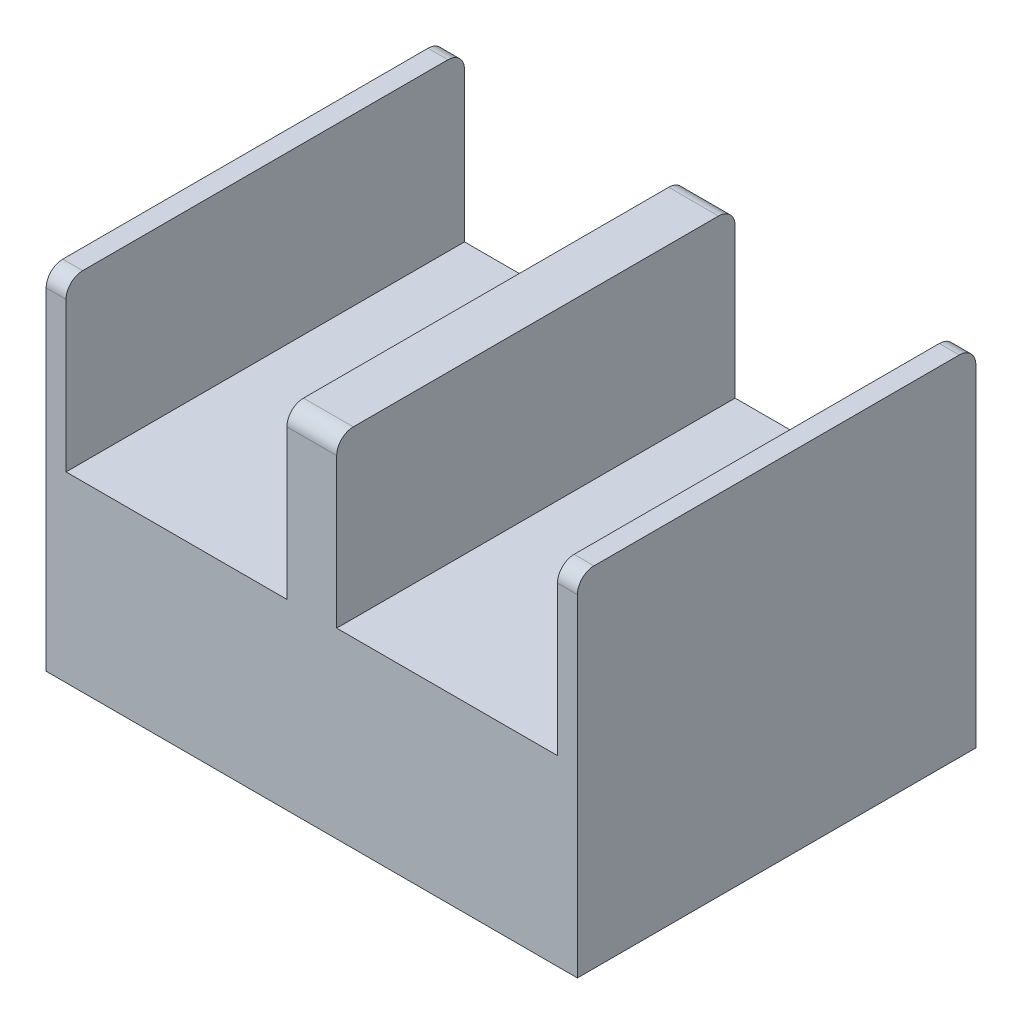
ISO-10303-21;
HEADER;
FILE_DESCRIPTION(('STEP AP214'),'2;1');
FILE_NAME('part.step','',(''),(''),'','','');
FILE_SCHEMA(('AUTOMOTIVE_DESIGN { 1 0 10303 214 1 1 1 1 }'));
ENDSEC;
DATA;
#1=APPLICATION_CONTEXT('core data for automotive mechanical design processes');
#2=APPLICATION_PROTOCOL_DEFINITION('international standard','automotive_design',2000,#1);
#3=PRODUCT_CONTEXT('',#1,'mechanical');
#4=PRODUCT('Part','Part','',(#3));
#5=PRODUCT_RELATED_PRODUCT_CATEGORY('part','',(#4));
#6=PRODUCT_DEFINITION_FORMATION('','',#4);
#7=PRODUCT_DEFINITION_CONTEXT('part definition',#1,'design');
#8=PRODUCT_DEFINITION('design','',#6,#7);
#9=PRODUCT_DEFINITION_SHAPE('','',#8);
#10=(LENGTH_UNIT() NAMED_UNIT(*) SI_UNIT(.MILLI.,.METRE.));
#11=(NAMED_UNIT(*) PLANE_ANGLE_UNIT() SI_UNIT($,.RADIAN.));
#12=(NAMED_UNIT(*) SI_UNIT($,.STERADIAN.) SOLID_ANGLE_UNIT());
#13=UNCERTAINTY_MEASURE_WITH_UNIT(LENGTH_MEASURE(1.E-05),#10,'distance_accuracy_value','');
#14=(GEOMETRIC_REPRESENTATION_CONTEXT(3) GLOBAL_UNCERTAINTY_ASSIGNED_CONTEXT((#13)) GLOBAL_UNIT_ASSIGNED_CONTEXT((#10,
#11,#12)) REPRESENTATION_CONTEXT('',''));
#15=CARTESIAN_POINT('',(0.,0.,0.));
#16=DIRECTION('',(0.,0.,1.));
#17=DIRECTION('',(1.,0.,0.));
#18=AXIS2_PLACEMENT_3D('',#15,#16,#17);
#19=CARTESIAN_POINT('',(0.,5.5,0.));
#20=DIRECTION('',(0.,-1.,0.));
#21=DIRECTION('',(0.,0.,-1.));
#22=AXIS2_PLACEMENT_3D('',#19,#20,#21);
#23=PLANE('',#22);
#24=CARTESIAN_POINT('',(-4.075,5.5,0.));
#25=DIRECTION('',(0.,1.,0.));
#26=DIRECTION('',(0.,0.,1.));
#27=AXIS2_PLACEMENT_3D('',#24,#25,#26);
#28=CIRCLE('',#27,1.25);
#29=CARTESIAN_POINT('',(-4.075,5.5,1.25));
#30=VERTEX_POINT('',#29);
#31=EDGE_CURVE('E314',#30,#30,#28,.T.);
#32=ORIENTED_EDGE('',*,*,#31,.F.);
#33=EDGE_LOOP('',(#32));
#34=FACE_BOUND('',#33,.T.);
#35=DIRECTION('',(0.,0.,1.));
#36=VECTOR('',#35,1.);
#37=CARTESIAN_POINT('',(-0.75,5.5,-6.));
#38=LINE('',#37,#36);
#39=CARTESIAN_POINT('',(-0.750000000000001,5.5,-6.));
#40=VERTEX_POINT('',#39);
#41=CARTESIAN_POINT('',(-0.750000000000001,5.5,6.));
#42=VERTEX_POINT('',#41);
#43=EDGE_CURVE('E184',#40,#42,#38,.T.);
#44=ORIENTED_EDGE('',*,*,#43,.F.);
#45=DIRECTION('',(-1.,0.,0.));
#46=VECTOR('',#45,1.);
#47=CARTESIAN_POINT('',(-8.,5.5,-6.));
#48=LINE('',#47,#46);
#49=CARTESIAN_POINT('',(-7.4,5.5,-6.));
#50=VERTEX_POINT('',#49);
#51=EDGE_CURVE('E223',#40,#50,#48,.T.);
#52=ORIENTED_EDGE('',*,*,#51,.T.);
#53=DIRECTION('',(0.,0.,-1.));
#54=VECTOR('',#53,1.);
#55=CARTESIAN_POINT('',(-7.4,5.5,-6.));
#56=LINE('',#55,#54);
#57=CARTESIAN_POINT('',(-7.4,5.5,6.));
#58=VERTEX_POINT('',#57);
#59=EDGE_CURVE('E209',#58,#50,#56,.T.);
#60=ORIENTED_EDGE('',*,*,#59,.F.);
#61=DIRECTION('',(1.,0.,0.));
#62=VECTOR('',#61,1.);
#63=CARTESIAN_POINT('',(-8.,5.5,6.));
#64=LINE('',#63,#62);
#65=EDGE_CURVE('E177',#58,#42,#64,.T.);
#66=ORIENTED_EDGE('',*,*,#65,.T.);
#67=EDGE_LOOP('',(#44,#52,#60,#66));
#68=FACE_BOUND('',#67,.T.);
#69=ADVANCED_FACE('F34',(#34,#68),#23,.F.);
#70=CARTESIAN_POINT('',(4.075,5.5,0.));
#71=DIRECTION('',(0.,1.,0.));
#72=DIRECTION('',(0.,0.,1.));
#73=AXIS2_PLACEMENT_3D('',#70,#71,#72);
#74=CIRCLE('',#73,1.25);
#75=CARTESIAN_POINT('',(4.075,5.5,1.25));
#76=VERTEX_POINT('',#75);
#77=EDGE_CURVE('E311',#76,#76,#74,.T.);
#78=ORIENTED_EDGE('',*,*,#77,.F.);
#79=EDGE_LOOP('',(#78));
#80=FACE_BOUND('',#79,.T.);
#81=DIRECTION('',(0.,0.,-1.));
#82=VECTOR('',#81,1.);
#83=CARTESIAN_POINT('',(0.75,5.5,-6.));
#84=LINE('',#83,#82);
#85=CARTESIAN_POINT('',(0.749999999999998,5.5,6.));
#86=VERTEX_POINT('',#85);
#87=CARTESIAN_POINT('',(0.750000000000001,5.5,-6.));
#88=VERTEX_POINT('',#87);
#89=EDGE_CURVE('E163',#86,#88,#84,.T.);
#90=ORIENTED_EDGE('',*,*,#89,.F.);
#91=CARTESIAN_POINT('',(7.4,5.5,6.));
#92=VERTEX_POINT('',#91);
#93=EDGE_CURVE('E171',#86,#92,#64,.T.);
#94=ORIENTED_EDGE('',*,*,#93,.T.);
#95=DIRECTION('',(0.,0.,1.));
#96=VECTOR('',#95,1.);
#97=CARTESIAN_POINT('',(7.4,5.5,6.));
#98=LINE('',#97,#96);
#99=CARTESIAN_POINT('',(7.4,5.5,-6.));
#100=VERTEX_POINT('',#99);
#101=EDGE_CURVE('E198',#100,#92,#98,.T.);
#102=ORIENTED_EDGE('',*,*,#101,.F.);
#103=EDGE_CURVE('E178',#100,#88,#48,.T.);
#104=ORIENTED_EDGE('',*,*,#103,.T.);
#105=EDGE_LOOP('',(#90,#94,#102,#104));
#106=FACE_BOUND('',#105,.T.);
#107=ADVANCED_FACE('F181',(#80,#106),#23,.F.);
#108=CARTESIAN_POINT('',(8.,5.5,6.));
#109=DIRECTION('',(-1.,0.,0.));
#110=DIRECTION('',(0.,0.,1.));
#111=AXIS2_PLACEMENT_3D('',#108,#109,#110);
#112=PLANE('',#111);
#113=DIRECTION('',(0.,-1.,0.));
#114=VECTOR('',#113,1.);
#115=CARTESIAN_POINT('',(8.,5.5,-6.));
#116=LINE('',#115,#114);
#117=CARTESIAN_POINT('',(8.,10.,-6.));
#118=VERTEX_POINT('',#117);
#119=CARTESIAN_POINT('',(8.,0.,-6.));
#120=VERTEX_POINT('',#119);
#121=EDGE_CURVE('E243',#118,#120,#116,.T.);
#122=ORIENTED_EDGE('',*,*,#121,.F.);
#123=CARTESIAN_POINT('',(8.,10.,-5.5));
#124=DIRECTION('',(-1.,0.,0.));
#125=DIRECTION('',(0.,0.,1.));
#126=AXIS2_PLACEMENT_3D('',#123,#124,#125);
#127=CIRCLE('',#126,0.5);
#128=CARTESIAN_POINT('',(8.,10.5,-5.5));
#129=VERTEX_POINT('',#128);
#130=EDGE_CURVE('E289',#118,#129,#127,.F.);
#131=ORIENTED_EDGE('',*,*,#130,.T.);
#132=DIRECTION('',(0.,0.,-1.));
#133=VECTOR('',#132,1.);
#134=CARTESIAN_POINT('',(8.,10.5,6.));
#135=LINE('',#134,#133);
#136=CARTESIAN_POINT('',(8.,10.5,5.5));
#137=VERTEX_POINT('',#136);
#138=EDGE_CURVE('E199',#137,#129,#135,.T.);
#139=ORIENTED_EDGE('',*,*,#138,.F.);
#140=CARTESIAN_POINT('',(8.,10.,5.5));
#141=DIRECTION('',(-1.,0.,0.));
#142=DIRECTION('',(0.,0.,1.));
#143=AXIS2_PLACEMENT_3D('',#140,#141,#142);
#144=CIRCLE('',#143,0.5);
#145=CARTESIAN_POINT('',(8.,10.,6.));
#146=VERTEX_POINT('',#145);
#147=EDGE_CURVE('E50',#137,#146,#144,.F.);
#148=ORIENTED_EDGE('',*,*,#147,.T.);
#149=DIRECTION('',(0.,-1.,0.));
#150=VECTOR('',#149,1.);
#151=CARTESIAN_POINT('',(8.,5.5,6.));
#152=LINE('',#151,#150);
#153=CARTESIAN_POINT('',(8.,0.,6.));
#154=VERTEX_POINT('',#153);
#155=EDGE_CURVE('E226',#146,#154,#152,.T.);
#156=ORIENTED_EDGE('',*,*,#155,.T.);
#157=DIRECTION('',(0.,0.,-1.));
#158=VECTOR('',#157,1.);
#159=CARTESIAN_POINT('',(8.,0.,6.));
#160=LINE('',#159,#158);
#161=EDGE_CURVE('E222',#154,#120,#160,.T.);
#162=ORIENTED_EDGE('',*,*,#161,.T.);
#163=EDGE_LOOP('',(#122,#131,#139,#148,#156,#162));
#164=FACE_BOUND('',#163,.T.);
#165=ADVANCED_FACE('F335',(#164),#112,.F.);
#166=CARTESIAN_POINT('',(-8.,5.5,-6.));
#167=DIRECTION('',(0.,0.,1.));
#168=DIRECTION('',(1.,0.,0.));
#169=AXIS2_PLACEMENT_3D('',#166,#167,#168);
#170=PLANE('',#169);
#171=DIRECTION('',(0.,-1.,0.));
#172=VECTOR('',#171,1.);
#173=CARTESIAN_POINT('',(-8.,5.5,-6.));
#174=LINE('',#173,#172);
#175=CARTESIAN_POINT('',(-8.,10.,-6.));
#176=VERTEX_POINT('',#175);
#177=CARTESIAN_POINT('',(-8.,0.,-6.));
#178=VERTEX_POINT('',#177);
#179=EDGE_CURVE('E241',#176,#178,#174,.T.);
#180=ORIENTED_EDGE('',*,*,#179,.F.);
#181=DIRECTION('',(-1.,0.,0.));
#182=VECTOR('',#181,1.);
#183=CARTESIAN_POINT('',(-7.4,10.,-6.));
#184=LINE('',#183,#182);
#185=CARTESIAN_POINT('',(-7.4,10.,-6.));
#186=VERTEX_POINT('',#185);
#187=EDGE_CURVE('E259',#176,#186,#184,.F.);
#188=ORIENTED_EDGE('',*,*,#187,.T.);
#189=DIRECTION('',(0.,-1.,0.));
#190=VECTOR('',#189,1.);
#191=CARTESIAN_POINT('',(-7.4,10.5,-6.));
#192=LINE('',#191,#190);
#193=EDGE_CURVE('E216',#186,#50,#192,.T.);
#194=ORIENTED_EDGE('',*,*,#193,.T.);
#195=ORIENTED_EDGE('',*,*,#51,.F.);
#196=DIRECTION('',(0.,-1.,0.));
#197=VECTOR('',#196,1.);
#198=CARTESIAN_POINT('',(-0.75,10.5,-6.));
#199=LINE('',#198,#197);
#200=CARTESIAN_POINT('',(-0.75,10.,-6.));
#201=VERTEX_POINT('',#200);
#202=EDGE_CURVE('E194',#201,#40,#199,.T.);
#203=ORIENTED_EDGE('',*,*,#202,.F.);
#204=DIRECTION('',(-1.,0.,0.));
#205=VECTOR('',#204,1.);
#206=CARTESIAN_POINT('',(0.75,10.,-6.));
#207=LINE('',#206,#205);
#208=CARTESIAN_POINT('',(0.75,10.,-6.));
#209=VERTEX_POINT('',#208);
#210=EDGE_CURVE('E257',#201,#209,#207,.F.);
#211=ORIENTED_EDGE('',*,*,#210,.T.);
#212=DIRECTION('',(0.,-1.,0.));
#213=VECTOR('',#212,1.);
#214=CARTESIAN_POINT('',(0.75,10.5,-6.));
#215=LINE('',#214,#213);
#216=EDGE_CURVE('E168',#209,#88,#215,.T.);
#217=ORIENTED_EDGE('',*,*,#216,.T.);
#218=ORIENTED_EDGE('',*,*,#103,.F.);
#219=DIRECTION('',(0.,-1.,0.));
#220=VECTOR('',#219,1.);
#221=CARTESIAN_POINT('',(7.4,10.5,-6.));
#222=LINE('',#221,#220);
#223=CARTESIAN_POINT('',(7.4,10.,-6.));
#224=VERTEX_POINT('',#223);
#225=EDGE_CURVE('E207',#224,#100,#222,.T.);
#226=ORIENTED_EDGE('',*,*,#225,.F.);
#227=DIRECTION('',(-1.,0.,0.));
#228=VECTOR('',#227,1.);
#229=CARTESIAN_POINT('',(8.,10.,-6.));
#230=LINE('',#229,#228);
#231=EDGE_CURVE('E255',#224,#118,#230,.F.);
#232=ORIENTED_EDGE('',*,*,#231,.T.);
#233=ORIENTED_EDGE('',*,*,#121,.T.);
#234=DIRECTION('',(-1.,0.,0.));
#235=VECTOR('',#234,1.);
#236=CARTESIAN_POINT('',(-8.,0.,-6.));
#237=LINE('',#236,#235);
#238=EDGE_CURVE('E229',#120,#178,#237,.T.);
#239=ORIENTED_EDGE('',*,*,#238,.T.);
#240=EDGE_LOOP('',(#180,#188,#194,#195,#203,#211,#217,#218,#226,#232,#233,#239));
#241=FACE_BOUND('',#240,.T.);
#242=ADVANCED_FACE('F347',(#241),#170,.F.);
#243=CARTESIAN_POINT('',(-8.,5.5,6.));
#244=DIRECTION('',(1.,0.,0.));
#245=DIRECTION('',(0.,0.,-1.));
#246=AXIS2_PLACEMENT_3D('',#243,#244,#245);
#247=PLANE('',#246);
#248=DIRECTION('',(0.,0.,1.));
#249=VECTOR('',#248,1.);
#250=CARTESIAN_POINT('',(-8.,10.5,-6.));
#251=LINE('',#250,#249);
#252=CARTESIAN_POINT('',(-8.,10.5,-5.5));
#253=VERTEX_POINT('',#252);
#254=CARTESIAN_POINT('',(-8.,10.5,5.5));
#255=VERTEX_POINT('',#254);
#256=EDGE_CURVE('E210',#253,#255,#251,.T.);
#257=ORIENTED_EDGE('',*,*,#256,.F.);
#258=CARTESIAN_POINT('',(-8.,10.,-5.5));
#259=DIRECTION('',(1.,0.,0.));
#260=DIRECTION('',(0.,0.,-1.));
#261=AXIS2_PLACEMENT_3D('',#258,#259,#260);
#262=CIRCLE('',#261,0.5);
#263=EDGE_CURVE('E253',#253,#176,#262,.F.);
#264=ORIENTED_EDGE('',*,*,#263,.T.);
#265=ORIENTED_EDGE('',*,*,#179,.T.);
#266=DIRECTION('',(0.,0.,1.));
#267=VECTOR('',#266,1.);
#268=CARTESIAN_POINT('',(-8.,0.,6.));
#269=LINE('',#268,#267);
#270=CARTESIAN_POINT('',(-8.,0.,6.));
#271=VERTEX_POINT('',#270);
#272=EDGE_CURVE('E232',#178,#271,#269,.T.);
#273=ORIENTED_EDGE('',*,*,#272,.T.);
#274=DIRECTION('',(0.,-1.,0.));
#275=VECTOR('',#274,1.);
#276=CARTESIAN_POINT('',(-8.,5.5,6.));
#277=LINE('',#276,#275);
#278=CARTESIAN_POINT('',(-8.,10.,6.));
#279=VERTEX_POINT('',#278);
#280=EDGE_CURVE('E239',#279,#271,#277,.T.);
#281=ORIENTED_EDGE('',*,*,#280,.F.);
#282=CARTESIAN_POINT('',(-8.,10.,5.5));
#283=DIRECTION('',(1.,0.,0.));
#284=DIRECTION('',(0.,0.,-1.));
#285=AXIS2_PLACEMENT_3D('',#282,#283,#284);
#286=CIRCLE('',#285,0.5);
#287=EDGE_CURVE('E251',#279,#255,#286,.F.);
#288=ORIENTED_EDGE('',*,*,#287,.T.);
#289=EDGE_LOOP('',(#257,#264,#265,#273,#281,#288));
#290=FACE_BOUND('',#289,.T.);
#291=ADVANCED_FACE('F343',(#290),#247,.F.);
#292=CARTESIAN_POINT('',(-8.,5.5,6.));
#293=DIRECTION('',(0.,0.,-1.));
#294=DIRECTION('',(-1.,0.,0.));
#295=AXIS2_PLACEMENT_3D('',#292,#293,#294);
#296=PLANE('',#295);
#297=ORIENTED_EDGE('',*,*,#155,.F.);
#298=DIRECTION('',(1.,0.,0.));
#299=VECTOR('',#298,1.);
#300=CARTESIAN_POINT('',(7.4,10.,6.));
#301=LINE('',#300,#299);
#302=CARTESIAN_POINT('',(7.4,10.,6.));
#303=VERTEX_POINT('',#302);
#304=EDGE_CURVE('E11',#146,#303,#301,.F.);
#305=ORIENTED_EDGE('',*,*,#304,.T.);
#306=DIRECTION('',(0.,-1.,0.));
#307=VECTOR('',#306,1.);
#308=CARTESIAN_POINT('',(7.4,10.5,6.));
#309=LINE('',#308,#307);
#310=EDGE_CURVE('E173',#303,#92,#309,.T.);
#311=ORIENTED_EDGE('',*,*,#310,.T.);
#312=ORIENTED_EDGE('',*,*,#93,.F.);
#313=DIRECTION('',(0.,-1.,0.));
#314=VECTOR('',#313,1.);
#315=CARTESIAN_POINT('',(0.749999999999998,10.5,6.));
#316=LINE('',#315,#314);
#317=CARTESIAN_POINT('',(0.749999999999998,10.,6.));
#318=VERTEX_POINT('',#317);
#319=EDGE_CURVE('E158',#318,#86,#316,.T.);
#320=ORIENTED_EDGE('',*,*,#319,.F.);
#321=DIRECTION('',(1.,0.,0.));
#322=VECTOR('',#321,1.);
#323=CARTESIAN_POINT('',(-0.749999999999998,10.,6.));
#324=LINE('',#323,#322);
#325=CARTESIAN_POINT('',(-0.749999999999998,10.,6.));
#326=VERTEX_POINT('',#325);
#327=EDGE_CURVE('E43',#318,#326,#324,.F.);
#328=ORIENTED_EDGE('',*,*,#327,.T.);
#329=DIRECTION('',(0.,-1.,0.));
#330=VECTOR('',#329,1.);
#331=CARTESIAN_POINT('',(-0.749999999999998,10.5,6.));
#332=LINE('',#331,#330);
#333=EDGE_CURVE('E167',#326,#42,#332,.T.);
#334=ORIENTED_EDGE('',*,*,#333,.T.);
#335=ORIENTED_EDGE('',*,*,#65,.F.);
#336=DIRECTION('',(0.,-1.,0.));
#337=VECTOR('',#336,1.);
#338=CARTESIAN_POINT('',(-7.4,10.5,6.));
#339=LINE('',#338,#337);
#340=CARTESIAN_POINT('',(-7.4,10.,6.));
#341=VERTEX_POINT('',#340);
#342=EDGE_CURVE('E220',#341,#58,#339,.T.);
#343=ORIENTED_EDGE('',*,*,#342,.F.);
#344=DIRECTION('',(1.,0.,0.));
#345=VECTOR('',#344,1.);
#346=CARTESIAN_POINT('',(-8.,10.,6.));
#347=LINE('',#346,#345);
#348=EDGE_CURVE('E291',#341,#279,#347,.F.);
#349=ORIENTED_EDGE('',*,*,#348,.T.);
#350=ORIENTED_EDGE('',*,*,#280,.T.);
#351=DIRECTION('',(1.,0.,0.));
#352=VECTOR('',#351,1.);
#353=CARTESIAN_POINT('',(-8.,0.,6.));
#354=LINE('',#353,#352);
#355=EDGE_CURVE('E235',#271,#154,#354,.T.);
#356=ORIENTED_EDGE('',*,*,#355,.T.);
#357=EDGE_LOOP('',(#297,#305,#311,#312,#320,#328,#334,#335,#343,#349,#350,#356));
#358=FACE_BOUND('',#357,.T.);
#359=ADVANCED_FACE('F172',(#358),#296,.F.);
#360=CARTESIAN_POINT('',(0.,0.,0.));
#361=DIRECTION('',(0.,-1.,0.));
#362=DIRECTION('',(0.,0.,-1.));
#363=AXIS2_PLACEMENT_3D('',#360,#361,#362);
#364=PLANE('',#363);
#365=CARTESIAN_POINT('',(-4.075,0.,0.));
#366=DIRECTION('',(0.,-1.,0.));
#367=DIRECTION('',(0.,0.,-1.));
#368=AXIS2_PLACEMENT_3D('',#365,#366,#367);
#369=CIRCLE('',#368,1.25);
#370=CARTESIAN_POINT('',(-4.075,0.,-1.25));
#371=VERTEX_POINT('',#370);
#372=EDGE_CURVE('E38',#371,#371,#369,.T.);
#373=ORIENTED_EDGE('',*,*,#372,.F.);
#374=EDGE_LOOP('',(#373));
#375=FACE_BOUND('',#374,.T.);
#376=CARTESIAN_POINT('',(4.075,0.,0.));
#377=DIRECTION('',(0.,-1.,0.));
#378=DIRECTION('',(0.,0.,-1.));
#379=AXIS2_PLACEMENT_3D('',#376,#377,#378);
#380=CIRCLE('',#379,1.25);
#381=CARTESIAN_POINT('',(4.075,0.,-1.25));
#382=VERTEX_POINT('',#381);
#383=EDGE_CURVE('E190',#382,#382,#380,.T.);
#384=ORIENTED_EDGE('',*,*,#383,.F.);
#385=EDGE_LOOP('',(#384));
#386=FACE_BOUND('',#385,.T.);
#387=ORIENTED_EDGE('',*,*,#161,.F.);
#388=ORIENTED_EDGE('',*,*,#355,.F.);
#389=ORIENTED_EDGE('',*,*,#272,.F.);
#390=ORIENTED_EDGE('',*,*,#238,.F.);
#391=EDGE_LOOP('',(#387,#388,#389,#390));
#392=FACE_BOUND('',#391,.T.);
#393=ADVANCED_FACE('F323',(#375,#386,#392),#364,.T.);
#394=CARTESIAN_POINT('',(-7.4,10.5,-6.));
#395=DIRECTION('',(-1.,0.,0.));
#396=DIRECTION('',(0.,0.,1.));
#397=AXIS2_PLACEMENT_3D('',#394,#395,#396);
#398=PLANE('',#397);
#399=ORIENTED_EDGE('',*,*,#193,.F.);
#400=CARTESIAN_POINT('',(-7.4,10.,-5.5));
#401=DIRECTION('',(-1.,0.,0.));
#402=DIRECTION('',(0.,0.,1.));
#403=AXIS2_PLACEMENT_3D('',#400,#401,#402);
#404=CIRCLE('',#403,0.5);
#405=CARTESIAN_POINT('',(-7.4,10.5,-5.5));
#406=VERTEX_POINT('',#405);
#407=EDGE_CURVE('E263',#186,#406,#404,.F.);
#408=ORIENTED_EDGE('',*,*,#407,.T.);
#409=DIRECTION('',(0.,0.,-1.));
#410=VECTOR('',#409,1.);
#411=CARTESIAN_POINT('',(-7.4,10.5,-6.));
#412=LINE('',#411,#410);
#413=CARTESIAN_POINT('',(-7.4,10.5,5.5));
#414=VERTEX_POINT('',#413);
#415=EDGE_CURVE('E213',#414,#406,#412,.T.);
#416=ORIENTED_EDGE('',*,*,#415,.F.);
#417=CARTESIAN_POINT('',(-7.4,10.,5.5));
#418=DIRECTION('',(-1.,0.,0.));
#419=DIRECTION('',(0.,0.,1.));
#420=AXIS2_PLACEMENT_3D('',#417,#418,#419);
#421=CIRCLE('',#420,0.5);
#422=EDGE_CURVE('E261',#414,#341,#421,.F.);
#423=ORIENTED_EDGE('',*,*,#422,.T.);
#424=ORIENTED_EDGE('',*,*,#342,.T.);
#425=ORIENTED_EDGE('',*,*,#59,.T.);
#426=EDGE_LOOP('',(#399,#408,#416,#423,#424,#425));
#427=FACE_BOUND('',#426,.T.);
#428=ADVANCED_FACE('F326',(#427),#398,.F.);
#429=CARTESIAN_POINT('',(0.,10.5,0.));
#430=DIRECTION('',(0.,1.,0.));
#431=DIRECTION('',(0.,0.,1.));
#432=AXIS2_PLACEMENT_3D('',#429,#430,#431);
#433=PLANE('',#432);
#434=ORIENTED_EDGE('',*,*,#415,.T.);
#435=DIRECTION('',(-1.,0.,0.));
#436=VECTOR('',#435,1.);
#437=CARTESIAN_POINT('',(-8.,10.5,-5.5));
#438=LINE('',#437,#436);
#439=EDGE_CURVE('E248',#406,#253,#438,.T.);
#440=ORIENTED_EDGE('',*,*,#439,.T.);
#441=ORIENTED_EDGE('',*,*,#256,.T.);
#442=DIRECTION('',(1.,0.,0.));
#443=VECTOR('',#442,1.);
#444=CARTESIAN_POINT('',(-7.4,10.5,5.5));
#445=LINE('',#444,#443);
#446=EDGE_CURVE('E245',#255,#414,#445,.T.);
#447=ORIENTED_EDGE('',*,*,#446,.T.);
#448=EDGE_LOOP('',(#434,#440,#441,#447));
#449=FACE_BOUND('',#448,.T.);
#450=ADVANCED_FACE('F377',(#449),#433,.T.);
#451=CARTESIAN_POINT('',(7.4,10.5,6.));
#452=DIRECTION('',(1.,0.,0.));
#453=DIRECTION('',(0.,0.,-1.));
#454=AXIS2_PLACEMENT_3D('',#451,#452,#453);
#455=PLANE('',#454);
#456=DIRECTION('',(0.,0.,1.));
#457=VECTOR('',#456,1.);
#458=CARTESIAN_POINT('',(7.4,10.5,6.));
#459=LINE('',#458,#457);
#460=CARTESIAN_POINT('',(7.4,10.5,-5.5));
#461=VERTEX_POINT('',#460);
#462=CARTESIAN_POINT('',(7.4,10.5,5.5));
#463=VERTEX_POINT('',#462);
#464=EDGE_CURVE('E202',#461,#463,#459,.T.);
#465=ORIENTED_EDGE('',*,*,#464,.F.);
#466=CARTESIAN_POINT('',(7.4,10.,-5.5));
#467=DIRECTION('',(1.,0.,0.));
#468=DIRECTION('',(0.,0.,-1.));
#469=AXIS2_PLACEMENT_3D('',#466,#467,#468);
#470=CIRCLE('',#469,0.5);
#471=EDGE_CURVE('E286',#461,#224,#470,.F.);
#472=ORIENTED_EDGE('',*,*,#471,.T.);
#473=ORIENTED_EDGE('',*,*,#225,.T.);
#474=ORIENTED_EDGE('',*,*,#101,.T.);
#475=ORIENTED_EDGE('',*,*,#310,.F.);
#476=CARTESIAN_POINT('',(7.4,10.,5.5));
#477=DIRECTION('',(1.,0.,0.));
#478=DIRECTION('',(0.,0.,-1.));
#479=AXIS2_PLACEMENT_3D('',#476,#477,#478);
#480=CIRCLE('',#479,0.5);
#481=EDGE_CURVE('E284',#303,#463,#480,.F.);
#482=ORIENTED_EDGE('',*,*,#481,.T.);
#483=EDGE_LOOP('',(#465,#472,#473,#474,#475,#482));
#484=FACE_BOUND('',#483,.T.);
#485=ADVANCED_FACE('F361',(#484),#455,.F.);
#486=CARTESIAN_POINT('',(0.,10.5,0.));
#487=DIRECTION('',(0.,1.,0.));
#488=DIRECTION('',(0.,0.,1.));
#489=AXIS2_PLACEMENT_3D('',#486,#487,#488);
#490=PLANE('',#489);
#491=ORIENTED_EDGE('',*,*,#138,.T.);
#492=DIRECTION('',(-1.,0.,0.));
#493=VECTOR('',#492,1.);
#494=CARTESIAN_POINT('',(7.4,10.5,-5.5));
#495=LINE('',#494,#493);
#496=EDGE_CURVE('E281',#129,#461,#495,.T.);
#497=ORIENTED_EDGE('',*,*,#496,.T.);
#498=ORIENTED_EDGE('',*,*,#464,.T.);
#499=DIRECTION('',(1.,0.,0.));
#500=VECTOR('',#499,1.);
#501=CARTESIAN_POINT('',(8.,10.5,5.5));
#502=LINE('',#501,#500);
#503=EDGE_CURVE('E278',#463,#137,#502,.T.);
#504=ORIENTED_EDGE('',*,*,#503,.T.);
#505=EDGE_LOOP('',(#491,#497,#498,#504));
#506=FACE_BOUND('',#505,.T.);
#507=ADVANCED_FACE('F354',(#506),#490,.T.);
#508=CARTESIAN_POINT('',(-0.75,10.5,-6.));
#509=DIRECTION('',(1.,0.,0.));
#510=DIRECTION('',(0.,0.,-1.));
#511=AXIS2_PLACEMENT_3D('',#508,#509,#510);
#512=PLANE('',#511);
#513=DIRECTION('',(0.,0.,1.));
#514=VECTOR('',#513,1.);
#515=CARTESIAN_POINT('',(-0.75,10.5,-6.));
#516=LINE('',#515,#514);
#517=CARTESIAN_POINT('',(-0.75,10.5,-5.5));
#518=VERTEX_POINT('',#517);
#519=CARTESIAN_POINT('',(-0.749999999999999,10.5,5.5));
#520=VERTEX_POINT('',#519);
#521=EDGE_CURVE('E183',#518,#520,#516,.T.);
#522=ORIENTED_EDGE('',*,*,#521,.F.);
#523=CARTESIAN_POINT('',(-0.75,10.,-5.5));
#524=DIRECTION('',(1.,0.,0.));
#525=DIRECTION('',(0.,0.,-1.));
#526=AXIS2_PLACEMENT_3D('',#523,#524,#525);
#527=CIRCLE('',#526,0.5);
#528=EDGE_CURVE('E273',#518,#201,#527,.F.);
#529=ORIENTED_EDGE('',*,*,#528,.T.);
#530=ORIENTED_EDGE('',*,*,#202,.T.);
#531=ORIENTED_EDGE('',*,*,#43,.T.);
#532=ORIENTED_EDGE('',*,*,#333,.F.);
#533=CARTESIAN_POINT('',(-0.749999999999999,10.,5.5));
#534=DIRECTION('',(1.,0.,0.));
#535=DIRECTION('',(0.,0.,-1.));
#536=AXIS2_PLACEMENT_3D('',#533,#534,#535);
#537=CIRCLE('',#536,0.5);
#538=EDGE_CURVE('E271',#326,#520,#537,.F.);
#539=ORIENTED_EDGE('',*,*,#538,.T.);
#540=EDGE_LOOP('',(#522,#529,#530,#531,#532,#539));
#541=FACE_BOUND('',#540,.T.);
#542=ADVANCED_FACE('F299',(#541),#512,.F.);
#543=CARTESIAN_POINT('',(0.75,10.5,-6.));
#544=DIRECTION('',(-1.,0.,0.));
#545=DIRECTION('',(0.,0.,1.));
#546=AXIS2_PLACEMENT_3D('',#543,#544,#545);
#547=PLANE('',#546);
#548=ORIENTED_EDGE('',*,*,#216,.F.);
#549=CARTESIAN_POINT('',(0.75,10.,-5.5));
#550=DIRECTION('',(-1.,0.,0.));
#551=DIRECTION('',(0.,0.,1.));
#552=AXIS2_PLACEMENT_3D('',#549,#550,#551);
#553=CIRCLE('',#552,0.5);
#554=CARTESIAN_POINT('',(0.75,10.5,-5.5));
#555=VERTEX_POINT('',#554);
#556=EDGE_CURVE('E276',#209,#555,#553,.F.);
#557=ORIENTED_EDGE('',*,*,#556,.T.);
#558=DIRECTION('',(0.,0.,-1.));
#559=VECTOR('',#558,1.);
#560=CARTESIAN_POINT('',(0.75,10.5,-6.));
#561=LINE('',#560,#559);
#562=CARTESIAN_POINT('',(0.749999999999999,10.5,5.5));
#563=VERTEX_POINT('',#562);
#564=EDGE_CURVE('E187',#563,#555,#561,.T.);
#565=ORIENTED_EDGE('',*,*,#564,.F.);
#566=CARTESIAN_POINT('',(0.749999999999999,10.,5.5));
#567=DIRECTION('',(-1.,0.,0.));
#568=DIRECTION('',(0.,0.,1.));
#569=AXIS2_PLACEMENT_3D('',#566,#567,#568);
#570=CIRCLE('',#569,0.5);
#571=EDGE_CURVE('E165',#563,#318,#570,.F.);
#572=ORIENTED_EDGE('',*,*,#571,.T.);
#573=ORIENTED_EDGE('',*,*,#319,.T.);
#574=ORIENTED_EDGE('',*,*,#89,.T.);
#575=EDGE_LOOP('',(#548,#557,#565,#572,#573,#574));
#576=FACE_BOUND('',#575,.T.);
#577=ADVANCED_FACE('F161',(#576),#547,.F.);
#578=CARTESIAN_POINT('',(0.,10.5,0.));
#579=DIRECTION('',(0.,1.,0.));
#580=DIRECTION('',(0.,0.,1.));
#581=AXIS2_PLACEMENT_3D('',#578,#579,#580);
#582=PLANE('',#581);
#583=ORIENTED_EDGE('',*,*,#564,.T.);
#584=DIRECTION('',(-1.,0.,0.));
#585=VECTOR('',#584,1.);
#586=CARTESIAN_POINT('',(-0.75,10.5,-5.5));
#587=LINE('',#586,#585);
#588=EDGE_CURVE('E268',#555,#518,#587,.T.);
#589=ORIENTED_EDGE('',*,*,#588,.T.);
#590=ORIENTED_EDGE('',*,*,#521,.T.);
#591=DIRECTION('',(1.,0.,0.));
#592=VECTOR('',#591,1.);
#593=CARTESIAN_POINT('',(0.749999999999998,10.5,5.5));
#594=LINE('',#593,#592);
#595=EDGE_CURVE('E265',#520,#563,#594,.T.);
#596=ORIENTED_EDGE('',*,*,#595,.T.);
#597=EDGE_LOOP('',(#583,#589,#590,#596));
#598=FACE_BOUND('',#597,.T.);
#599=ADVANCED_FACE('F305',(#598),#582,.T.);
#600=CARTESIAN_POINT('',(0.,10.,-5.5));
#601=DIRECTION('',(1.,0.,0.));
#602=DIRECTION('',(0.,0.,-1.));
#603=AXIS2_PLACEMENT_3D('',#600,#601,#602);
#604=CYLINDRICAL_SURFACE('',#603,0.5);
#605=ORIENTED_EDGE('',*,*,#407,.F.);
#606=ORIENTED_EDGE('',*,*,#187,.F.);
#607=ORIENTED_EDGE('',*,*,#263,.F.);
#608=ORIENTED_EDGE('',*,*,#439,.F.);
#609=EDGE_LOOP('',(#605,#606,#607,#608));
#610=FACE_BOUND('',#609,.T.);
#611=ADVANCED_FACE('F380',(#610),#604,.T.);
#612=CARTESIAN_POINT('',(0.,10.,-5.5));
#613=DIRECTION('',(1.,0.,0.));
#614=DIRECTION('',(0.,0.,-1.));
#615=AXIS2_PLACEMENT_3D('',#612,#613,#614);
#616=CYLINDRICAL_SURFACE('',#615,0.5);
#617=ORIENTED_EDGE('',*,*,#556,.F.);
#618=ORIENTED_EDGE('',*,*,#210,.F.);
#619=ORIENTED_EDGE('',*,*,#528,.F.);
#620=ORIENTED_EDGE('',*,*,#588,.F.);
#621=EDGE_LOOP('',(#617,#618,#619,#620));
#622=FACE_BOUND('',#621,.T.);
#623=ADVANCED_FACE('F365',(#622),#616,.T.);
#624=CARTESIAN_POINT('',(0.,10.,-5.5));
#625=DIRECTION('',(1.,0.,0.));
#626=DIRECTION('',(0.,0.,-1.));
#627=AXIS2_PLACEMENT_3D('',#624,#625,#626);
#628=CYLINDRICAL_SURFACE('',#627,0.5);
#629=ORIENTED_EDGE('',*,*,#130,.F.);
#630=ORIENTED_EDGE('',*,*,#231,.F.);
#631=ORIENTED_EDGE('',*,*,#471,.F.);
#632=ORIENTED_EDGE('',*,*,#496,.F.);
#633=EDGE_LOOP('',(#629,#630,#631,#632));
#634=FACE_BOUND('',#633,.T.);
#635=ADVANCED_FACE('F351',(#634),#628,.T.);
#636=CARTESIAN_POINT('',(0.,10.,5.5));
#637=DIRECTION('',(-1.,0.,0.));
#638=DIRECTION('',(0.,0.,1.));
#639=AXIS2_PLACEMENT_3D('',#636,#637,#638);
#640=CYLINDRICAL_SURFACE('',#639,0.5);
#641=ORIENTED_EDGE('',*,*,#481,.F.);
#642=ORIENTED_EDGE('',*,*,#304,.F.);
#643=ORIENTED_EDGE('',*,*,#147,.F.);
#644=ORIENTED_EDGE('',*,*,#503,.F.);
#645=EDGE_LOOP('',(#641,#642,#643,#644));
#646=FACE_BOUND('',#645,.T.);
#647=ADVANCED_FACE('F359',(#646),#640,.T.);
#648=CARTESIAN_POINT('',(0.,10.,5.5));
#649=DIRECTION('',(-1.,0.,0.));
#650=DIRECTION('',(0.,0.,1.));
#651=AXIS2_PLACEMENT_3D('',#648,#649,#650);
#652=CYLINDRICAL_SURFACE('',#651,0.5);
#653=ORIENTED_EDGE('',*,*,#538,.F.);
#654=ORIENTED_EDGE('',*,*,#327,.F.);
#655=ORIENTED_EDGE('',*,*,#571,.F.);
#656=ORIENTED_EDGE('',*,*,#595,.F.);
#657=EDGE_LOOP('',(#653,#654,#655,#656));
#658=FACE_BOUND('',#657,.T.);
#659=ADVANCED_FACE('F302',(#658),#652,.T.);
#660=CARTESIAN_POINT('',(0.,10.,5.5));
#661=DIRECTION('',(-1.,0.,0.));
#662=DIRECTION('',(0.,0.,1.));
#663=AXIS2_PLACEMENT_3D('',#660,#661,#662);
#664=CYLINDRICAL_SURFACE('',#663,0.5);
#665=ORIENTED_EDGE('',*,*,#287,.F.);
#666=ORIENTED_EDGE('',*,*,#348,.F.);
#667=ORIENTED_EDGE('',*,*,#422,.F.);
#668=ORIENTED_EDGE('',*,*,#446,.F.);
#669=EDGE_LOOP('',(#665,#666,#667,#668));
#670=FACE_BOUND('',#669,.T.);
#671=ADVANCED_FACE('F36',(#670),#664,.T.);
#672=CARTESIAN_POINT('',(4.075,5.5,0.));
#673=DIRECTION('',(0.,1.,0.));
#674=DIRECTION('',(0.,0.,1.));
#675=AXIS2_PLACEMENT_3D('',#672,#673,#674);
#676=CYLINDRICAL_SURFACE('',#675,1.25);
#677=ORIENTED_EDGE('',*,*,#383,.T.);
#678=EDGE_LOOP('',(#677));
#679=FACE_BOUND('',#678,.T.);
#680=ORIENTED_EDGE('',*,*,#77,.T.);
#681=EDGE_LOOP('',(#680));
#682=FACE_BOUND('',#681,.T.);
#683=ADVANCED_FACE('F506',(#679,#682),#676,.F.);
#684=CARTESIAN_POINT('',(-4.075,5.5,0.));
#685=DIRECTION('',(0.,1.,0.));
#686=DIRECTION('',(0.,0.,1.));
#687=AXIS2_PLACEMENT_3D('',#684,#685,#686);
#688=CYLINDRICAL_SURFACE('',#687,1.25);
#689=ORIENTED_EDGE('',*,*,#372,.T.);
#690=EDGE_LOOP('',(#689));
#691=FACE_BOUND('',#690,.T.);
#692=ORIENTED_EDGE('',*,*,#31,.T.);
#693=EDGE_LOOP('',(#692));
#694=FACE_BOUND('',#693,.T.);
#695=ADVANCED_FACE('F321',(#691,#694),#688,.F.);
#696=CLOSED_SHELL('',(#69,#107,#165,#242,#291,#359,#393,#428,#450,#485,#507,#542,#577,#599,#611,
#623,#635,#647,#659,#671,#683,#695));
#697=MANIFOLD_SOLID_BREP('B2',#696);
#698=ADVANCED_BREP_SHAPE_REPRESENTATION('',(#18,#697),#14);
#699=SHAPE_DEFINITION_REPRESENTATION(#9,#698);
ENDSEC;
END-ISO-10303-21;
